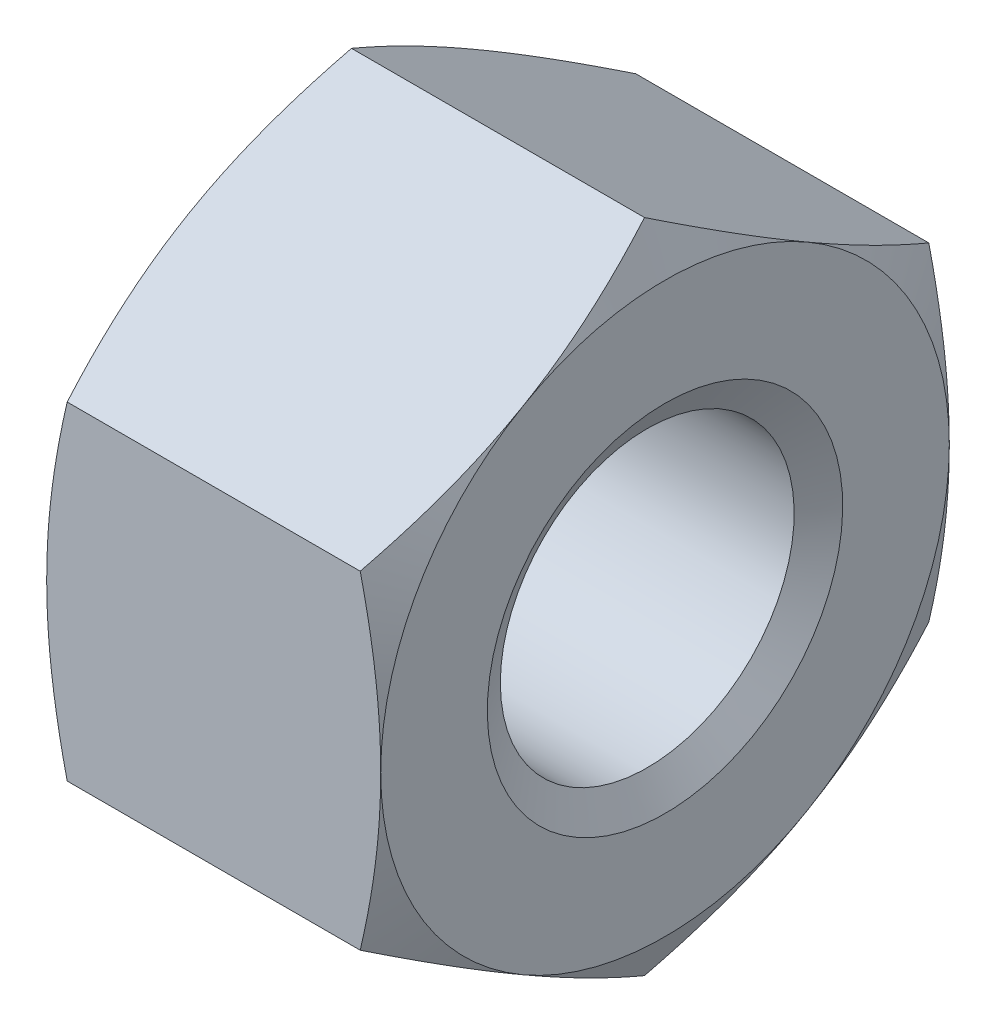
ISO-10303-21;
HEADER;
FILE_DESCRIPTION(('STEP AP214'),'2;1');
FILE_NAME('part.step','',(''),(''),'','','');
FILE_SCHEMA(('AUTOMOTIVE_DESIGN { 1 0 10303 214 1 1 1 1 }'));
ENDSEC;
DATA;
#1=APPLICATION_CONTEXT('core data for automotive mechanical design processes');
#2=APPLICATION_PROTOCOL_DEFINITION('international standard','automotive_design',2000,#1);
#3=PRODUCT_CONTEXT('',#1,'mechanical');
#4=PRODUCT('Part','Part','',(#3));
#5=PRODUCT_RELATED_PRODUCT_CATEGORY('part','',(#4));
#6=PRODUCT_DEFINITION_FORMATION('','',#4);
#7=PRODUCT_DEFINITION_CONTEXT('part definition',#1,'design');
#8=PRODUCT_DEFINITION('design','',#6,#7);
#9=PRODUCT_DEFINITION_SHAPE('','',#8);
#10=(LENGTH_UNIT() NAMED_UNIT(*) SI_UNIT(.MILLI.,.METRE.));
#11=(NAMED_UNIT(*) PLANE_ANGLE_UNIT() SI_UNIT($,.RADIAN.));
#12=(NAMED_UNIT(*) SI_UNIT($,.STERADIAN.) SOLID_ANGLE_UNIT());
#13=UNCERTAINTY_MEASURE_WITH_UNIT(LENGTH_MEASURE(1.E-05),#10,'distance_accuracy_value','');
#14=(GEOMETRIC_REPRESENTATION_CONTEXT(3) GLOBAL_UNCERTAINTY_ASSIGNED_CONTEXT((#13)) GLOBAL_UNIT_ASSIGNED_CONTEXT((#10,
#11,#12)) REPRESENTATION_CONTEXT('',''));
#15=CARTESIAN_POINT('',(0.,0.,0.));
#16=DIRECTION('',(0.,0.,1.));
#17=DIRECTION('',(1.,0.,0.));
#18=AXIS2_PLACEMENT_3D('',#15,#16,#17);
#19=CARTESIAN_POINT('',(0.125,0.,0.));
#20=DIRECTION('',(-1.,0.,0.));
#21=DIRECTION('',(0.,0.,1.));
#22=AXIS2_PLACEMENT_3D('',#19,#20,#21);
#23=CONICAL_SURFACE('',#22,2.28350635094611,1.0471975511966);
#24=CARTESIAN_POINT('',(0.25,0.,0.));
#25=DIRECTION('',(1.,0.,0.));
#26=DIRECTION('',(0.,1.,0.));
#27=AXIS2_PLACEMENT_3D('',#24,#25,#26);
#28=CIRCLE('',#27,2.067);
#29=CARTESIAN_POINT('',(0.25,2.067,0.));
#30=VERTEX_POINT('',#29);
#31=EDGE_CURVE('E9',#30,#30,#28,.T.);
#32=ORIENTED_EDGE('',*,*,#31,.T.);
#33=EDGE_LOOP('',(#32));
#34=FACE_BOUND('',#33,.T.);
#35=CARTESIAN_POINT('',(0.,0.,0.));
#36=DIRECTION('',(-1.,0.,0.));
#37=DIRECTION('',(0.,0.,1.));
#38=AXIS2_PLACEMENT_3D('',#35,#36,#37);
#39=CIRCLE('',#38,2.50001270189222);
#40=CARTESIAN_POINT('',(0.,0.,2.50001270189222));
#41=VERTEX_POINT('',#40);
#42=EDGE_CURVE('E25',#41,#41,#39,.T.);
#43=ORIENTED_EDGE('',*,*,#42,.T.);
#44=EDGE_LOOP('',(#43));
#45=FACE_BOUND('',#44,.T.);
#46=ADVANCED_FACE('F15',(#34,#45),#23,.F.);
#47=CARTESIAN_POINT('',(-8.39287337956546,0.,0.));
#48=DIRECTION('',(1.,0.,0.));
#49=DIRECTION('',(0.,1.,0.));
#50=AXIS2_PLACEMENT_3D('',#47,#48,#49);
#51=CYLINDRICAL_SURFACE('',#50,2.067);
#52=CARTESIAN_POINT('',(4.45,0.,0.));
#53=DIRECTION('',(-1.,0.,0.));
#54=DIRECTION('',(0.,0.,1.));
#55=AXIS2_PLACEMENT_3D('',#52,#53,#54);
#56=CIRCLE('',#55,2.067);
#57=CARTESIAN_POINT('',(4.45,0.,2.067));
#58=VERTEX_POINT('',#57);
#59=EDGE_CURVE('E330',#58,#58,#56,.T.);
#60=ORIENTED_EDGE('',*,*,#59,.F.);
#61=EDGE_LOOP('',(#60));
#62=FACE_BOUND('',#61,.T.);
#63=ORIENTED_EDGE('',*,*,#31,.F.);
#64=EDGE_LOOP('',(#63));
#65=FACE_BOUND('',#64,.T.);
#66=ADVANCED_FACE('F358',(#62,#65),#51,.F.);
#67=CARTESIAN_POINT('',(0.,0.,0.));
#68=DIRECTION('',(1.,0.,0.));
#69=DIRECTION('',(0.,0.,-1.));
#70=AXIS2_PLACEMENT_3D('',#67,#68,#69);
#71=PLANE('',#70);
#72=CARTESIAN_POINT('',(0.,0.,0.));
#73=DIRECTION('',(-1.,0.,0.));
#74=DIRECTION('',(0.,0.,1.));
#75=AXIS2_PLACEMENT_3D('',#72,#73,#74);
#76=CIRCLE('',#75,4.);
#77=CARTESIAN_POINT('',(0.,-3.46410161513775,-2.));
#78=VERTEX_POINT('',#77);
#79=CARTESIAN_POINT('',(0.,-3.46410161513776,2.));
#80=VERTEX_POINT('',#79);
#81=EDGE_CURVE('E346',#78,#80,#76,.T.);
#82=ORIENTED_EDGE('',*,*,#81,.T.);
#83=CARTESIAN_POINT('',(0.,0.,0.));
#84=DIRECTION('',(-1.,0.,0.));
#85=DIRECTION('',(0.,0.,1.));
#86=AXIS2_PLACEMENT_3D('',#83,#84,#85);
#87=CIRCLE('',#86,4.);
#88=CARTESIAN_POINT('',(0.,0.,4.));
#89=VERTEX_POINT('',#88);
#90=EDGE_CURVE('E343',#80,#89,#87,.T.);
#91=ORIENTED_EDGE('',*,*,#90,.T.);
#92=CARTESIAN_POINT('',(0.,0.,0.));
#93=DIRECTION('',(-1.,0.,0.));
#94=DIRECTION('',(0.,0.,1.));
#95=AXIS2_PLACEMENT_3D('',#92,#93,#94);
#96=CIRCLE('',#95,4.);
#97=CARTESIAN_POINT('',(0.,3.46410161513775,2.));
#98=VERTEX_POINT('',#97);
#99=EDGE_CURVE('E340',#89,#98,#96,.T.);
#100=ORIENTED_EDGE('',*,*,#99,.T.);
#101=CARTESIAN_POINT('',(0.,0.,0.));
#102=DIRECTION('',(-1.,0.,0.));
#103=DIRECTION('',(0.,0.,1.));
#104=AXIS2_PLACEMENT_3D('',#101,#102,#103);
#105=CIRCLE('',#104,4.);
#106=CARTESIAN_POINT('',(0.,3.46410161513776,-2.));
#107=VERTEX_POINT('',#106);
#108=EDGE_CURVE('E337',#98,#107,#105,.T.);
#109=ORIENTED_EDGE('',*,*,#108,.T.);
#110=CARTESIAN_POINT('',(0.,0.,0.));
#111=DIRECTION('',(-1.,0.,0.));
#112=DIRECTION('',(0.,0.,1.));
#113=AXIS2_PLACEMENT_3D('',#110,#111,#112);
#114=CIRCLE('',#113,4.);
#115=CARTESIAN_POINT('',(0.,0.,-4.));
#116=VERTEX_POINT('',#115);
#117=EDGE_CURVE('E334',#107,#116,#114,.T.);
#118=ORIENTED_EDGE('',*,*,#117,.T.);
#119=CARTESIAN_POINT('',(0.,0.,0.));
#120=DIRECTION('',(-1.,0.,0.));
#121=DIRECTION('',(0.,0.,1.));
#122=AXIS2_PLACEMENT_3D('',#119,#120,#121);
#123=CIRCLE('',#122,4.);
#124=EDGE_CURVE('E331',#116,#78,#123,.T.);
#125=ORIENTED_EDGE('',*,*,#124,.T.);
#126=EDGE_LOOP('',(#82,#91,#100,#109,#118,#125));
#127=FACE_BOUND('',#126,.T.);
#128=ORIENTED_EDGE('',*,*,#42,.F.);
#129=EDGE_LOOP('',(#128));
#130=FACE_BOUND('',#129,.T.);
#131=ADVANCED_FACE('F355',(#127,#130),#71,.F.);
#132=CARTESIAN_POINT('',(4.575,0.,0.));
#133=DIRECTION('',(1.,0.,0.));
#134=DIRECTION('',(0.,1.,0.));
#135=AXIS2_PLACEMENT_3D('',#132,#133,#134);
#136=CONICAL_SURFACE('',#135,2.28350635094611,1.0471975511966);
#137=ORIENTED_EDGE('',*,*,#59,.T.);
#138=EDGE_LOOP('',(#137));
#139=FACE_BOUND('',#138,.T.);
#140=CARTESIAN_POINT('',(4.7,0.,0.));
#141=DIRECTION('',(1.,0.,0.));
#142=DIRECTION('',(0.,1.,0.));
#143=AXIS2_PLACEMENT_3D('',#140,#141,#142);
#144=CIRCLE('',#143,2.50001270189222);
#145=CARTESIAN_POINT('',(4.7,2.50001270189222,0.));
#146=VERTEX_POINT('',#145);
#147=EDGE_CURVE('E327',#146,#146,#144,.T.);
#148=ORIENTED_EDGE('',*,*,#147,.T.);
#149=EDGE_LOOP('',(#148));
#150=FACE_BOUND('',#149,.T.);
#151=ADVANCED_FACE('F357',(#139,#150),#136,.F.);
#152=CARTESIAN_POINT('',(4.7,0.,0.));
#153=DIRECTION('',(1.,0.,0.));
#154=DIRECTION('',(0.,0.,-1.));
#155=AXIS2_PLACEMENT_3D('',#152,#153,#154);
#156=PLANE('',#155);
#157=CARTESIAN_POINT('',(4.7,0.,0.));
#158=DIRECTION('',(1.,0.,0.));
#159=DIRECTION('',(0.,1.,0.));
#160=AXIS2_PLACEMENT_3D('',#157,#158,#159);
#161=CIRCLE('',#160,4.);
#162=CARTESIAN_POINT('',(4.7,-3.46410161513775,-2.));
#163=VERTEX_POINT('',#162);
#164=CARTESIAN_POINT('',(4.7,0.,-4.));
#165=VERTEX_POINT('',#164);
#166=EDGE_CURVE('E324',#163,#165,#161,.T.);
#167=ORIENTED_EDGE('',*,*,#166,.T.);
#168=CARTESIAN_POINT('',(4.7,0.,0.));
#169=DIRECTION('',(1.,0.,0.));
#170=DIRECTION('',(0.,1.,0.));
#171=AXIS2_PLACEMENT_3D('',#168,#169,#170);
#172=CIRCLE('',#171,4.);
#173=CARTESIAN_POINT('',(4.7,3.46410161513776,-2.));
#174=VERTEX_POINT('',#173);
#175=EDGE_CURVE('E322',#165,#174,#172,.T.);
#176=ORIENTED_EDGE('',*,*,#175,.T.);
#177=CARTESIAN_POINT('',(4.7,0.,0.));
#178=DIRECTION('',(1.,0.,0.));
#179=DIRECTION('',(0.,1.,0.));
#180=AXIS2_PLACEMENT_3D('',#177,#178,#179);
#181=CIRCLE('',#180,4.);
#182=CARTESIAN_POINT('',(4.7,3.46410161513775,2.));
#183=VERTEX_POINT('',#182);
#184=EDGE_CURVE('E112',#174,#183,#181,.T.);
#185=ORIENTED_EDGE('',*,*,#184,.T.);
#186=CARTESIAN_POINT('',(4.7,0.,0.));
#187=DIRECTION('',(1.,0.,0.));
#188=DIRECTION('',(0.,1.,0.));
#189=AXIS2_PLACEMENT_3D('',#186,#187,#188);
#190=CIRCLE('',#189,4.);
#191=CARTESIAN_POINT('',(4.7,0.,4.));
#192=VERTEX_POINT('',#191);
#193=EDGE_CURVE('E318',#183,#192,#190,.T.);
#194=ORIENTED_EDGE('',*,*,#193,.T.);
#195=CARTESIAN_POINT('',(4.7,0.,0.));
#196=DIRECTION('',(1.,0.,0.));
#197=DIRECTION('',(0.,1.,0.));
#198=AXIS2_PLACEMENT_3D('',#195,#196,#197);
#199=CIRCLE('',#198,4.);
#200=CARTESIAN_POINT('',(4.7,-3.46410161513776,2.));
#201=VERTEX_POINT('',#200);
#202=EDGE_CURVE('E315',#192,#201,#199,.T.);
#203=ORIENTED_EDGE('',*,*,#202,.T.);
#204=CARTESIAN_POINT('',(4.7,0.,0.));
#205=DIRECTION('',(1.,0.,0.));
#206=DIRECTION('',(0.,1.,0.));
#207=AXIS2_PLACEMENT_3D('',#204,#205,#206);
#208=CIRCLE('',#207,4.);
#209=EDGE_CURVE('E237',#201,#163,#208,.T.);
#210=ORIENTED_EDGE('',*,*,#209,.T.);
#211=EDGE_LOOP('',(#167,#176,#185,#194,#203,#210));
#212=FACE_BOUND('',#211,.T.);
#213=ORIENTED_EDGE('',*,*,#147,.F.);
#214=EDGE_LOOP('',(#213));
#215=FACE_BOUND('',#214,.T.);
#216=ADVANCED_FACE('F366',(#212,#215),#156,.T.);
#217=CARTESIAN_POINT('',(0.144276091533892,0.,0.));
#218=DIRECTION('',(1.,0.,0.));
#219=DIRECTION('',(0.,0.,1.));
#220=AXIS2_PLACEMENT_3D('',#217,#218,#219);
#221=CONICAL_SURFACE('',#220,4.3094010767585,1.13446401379631);
#222=CARTESIAN_POINT('',(0.,-3.46410161513776,2.));
#223=CARTESIAN_POINT('',(0.,-4.,1.07179676972449));
#224=CARTESIAN_POINT('',(0.288552183067785,-4.618802153517,0.));
#225=(BOUNDED_CURVE() B_SPLINE_CURVE(2,(#222,#223,#224),.UNSPECIFIED.,.F.,
.F.) B_SPLINE_CURVE_WITH_KNOTS((3,3),(0.233129855179429,0.466259710358859),
.UNSPECIFIED.) CURVE() GEOMETRIC_REPRESENTATION_ITEM() RATIONAL_B_SPLINE_CURVE((1.,
1.03795484930205,1.)) REPRESENTATION_ITEM(''));
#226=CARTESIAN_POINT('',(0.288552183067785,-4.61880215351701,0.));
#227=VERTEX_POINT('',#226);
#228=EDGE_CURVE('E34',#80,#227,#225,.T.);
#229=ORIENTED_EDGE('',*,*,#228,.F.);
#230=ORIENTED_EDGE('',*,*,#81,.F.);
#231=CARTESIAN_POINT('',(0.288552183067785,-4.61880215351701,0.));
#232=CARTESIAN_POINT('',(0.,-4.,-1.07179676972449));
#233=CARTESIAN_POINT('',(0.,-3.46410161513775,-2.));
#234=(BOUNDED_CURVE() B_SPLINE_CURVE(2,(#231,#232,#233),.UNSPECIFIED.,.F.,
.F.) B_SPLINE_CURVE_WITH_KNOTS((3,3),(0.,0.23312985517943),
.UNSPECIFIED.) CURVE() GEOMETRIC_REPRESENTATION_ITEM() RATIONAL_B_SPLINE_CURVE((1.,
1.03795484930204,1.)) REPRESENTATION_ITEM(''));
#235=EDGE_CURVE('E224',#227,#78,#234,.T.);
#236=ORIENTED_EDGE('',*,*,#235,.F.);
#237=EDGE_LOOP('',(#229,#230,#236));
#238=FACE_BOUND('',#237,.T.);
#239=ADVANCED_FACE('F379',(#238),#221,.T.);
#240=CARTESIAN_POINT('',(0.144276091533892,0.,0.));
#241=DIRECTION('',(1.,0.,0.));
#242=DIRECTION('',(0.,0.,1.));
#243=AXIS2_PLACEMENT_3D('',#240,#241,#242);
#244=CONICAL_SURFACE('',#243,4.3094010767585,1.13446401379631);
#245=CARTESIAN_POINT('',(0.288552183067785,-2.30940107675848,-4.00000000000001));
#246=CARTESIAN_POINT('',(0.,-1.07179676972447,-4.00000000000001));
#247=CARTESIAN_POINT('',(0.,0.,-4.));
#248=(BOUNDED_CURVE() B_SPLINE_CURVE(2,(#245,#246,#247),.UNSPECIFIED.,.F.,
.F.) B_SPLINE_CURVE_WITH_KNOTS((3,3),(0.,0.233129855179429),
.UNSPECIFIED.) CURVE() GEOMETRIC_REPRESENTATION_ITEM() RATIONAL_B_SPLINE_CURVE((1.,
1.03795484930204,1.)) REPRESENTATION_ITEM(''));
#249=CARTESIAN_POINT('',(0.288552183067785,-2.30940107675848,-4.00000000000001));
#250=VERTEX_POINT('',#249);
#251=EDGE_CURVE('E157',#250,#116,#248,.T.);
#252=ORIENTED_EDGE('',*,*,#251,.F.);
#253=CARTESIAN_POINT('',(0.,-3.46410161513775,-2.));
#254=CARTESIAN_POINT('',(0.,-2.9282032302755,-2.92820323027551));
#255=CARTESIAN_POINT('',(0.288552183067785,-2.3094010767585,-4.));
#256=(BOUNDED_CURVE() B_SPLINE_CURVE(2,(#253,#254,#255),.UNSPECIFIED.,.F.,
.F.) B_SPLINE_CURVE_WITH_KNOTS((3,3),(0.23312985517943,0.46625971035886),
.UNSPECIFIED.) CURVE() GEOMETRIC_REPRESENTATION_ITEM() RATIONAL_B_SPLINE_CURVE((1.,
1.03795484930204,1.)) REPRESENTATION_ITEM(''));
#257=EDGE_CURVE('E284',#78,#250,#256,.T.);
#258=ORIENTED_EDGE('',*,*,#257,.F.);
#259=ORIENTED_EDGE('',*,*,#124,.F.);
#260=EDGE_LOOP('',(#252,#258,#259));
#261=FACE_BOUND('',#260,.T.);
#262=ADVANCED_FACE('F382',(#261),#244,.T.);
#263=CARTESIAN_POINT('',(0.144276091533892,0.,0.));
#264=DIRECTION('',(1.,0.,0.));
#265=DIRECTION('',(0.,0.,1.));
#266=AXIS2_PLACEMENT_3D('',#263,#264,#265);
#267=CONICAL_SURFACE('',#266,4.3094010767585,1.13446401379631);
#268=CARTESIAN_POINT('',(0.,0.,4.));
#269=CARTESIAN_POINT('',(0.,-1.07179676972449,4.));
#270=CARTESIAN_POINT('',(0.288552183067785,-2.3094010767585,4.));
#271=(BOUNDED_CURVE() B_SPLINE_CURVE(2,(#268,#269,#270),.UNSPECIFIED.,.F.,
.F.) B_SPLINE_CURVE_WITH_KNOTS((3,3),(0.233129855179429,0.466259710358859),
.UNSPECIFIED.) CURVE() GEOMETRIC_REPRESENTATION_ITEM() RATIONAL_B_SPLINE_CURVE((1.,
1.03795484930203,1.)) REPRESENTATION_ITEM(''));
#272=CARTESIAN_POINT('',(0.288552183067785,-2.3094010767585,4.));
#273=VERTEX_POINT('',#272);
#274=EDGE_CURVE('E142',#89,#273,#271,.T.);
#275=ORIENTED_EDGE('',*,*,#274,.F.);
#276=ORIENTED_EDGE('',*,*,#90,.F.);
#277=CARTESIAN_POINT('',(0.288552183067785,-2.30940107675851,4.));
#278=CARTESIAN_POINT('',(0.,-2.92820323027551,2.92820323027551));
#279=CARTESIAN_POINT('',(0.,-3.46410161513776,2.));
#280=(BOUNDED_CURVE() B_SPLINE_CURVE(2,(#277,#278,#279),.UNSPECIFIED.,.F.,
.F.) B_SPLINE_CURVE_WITH_KNOTS((3,3),(0.,0.233129855179429),
.UNSPECIFIED.) CURVE() GEOMETRIC_REPRESENTATION_ITEM() RATIONAL_B_SPLINE_CURVE((1.,
1.03795484930205,1.)) REPRESENTATION_ITEM(''));
#281=EDGE_CURVE('E185',#273,#80,#280,.T.);
#282=ORIENTED_EDGE('',*,*,#281,.F.);
#283=EDGE_LOOP('',(#275,#276,#282));
#284=FACE_BOUND('',#283,.T.);
#285=ADVANCED_FACE('F385',(#284),#267,.T.);
#286=CARTESIAN_POINT('',(0.144276091533892,0.,0.));
#287=DIRECTION('',(1.,0.,0.));
#288=DIRECTION('',(0.,0.,1.));
#289=AXIS2_PLACEMENT_3D('',#286,#287,#288);
#290=CONICAL_SURFACE('',#289,4.3094010767585,1.13446401379631);
#291=CARTESIAN_POINT('',(0.288552183067785,2.30940107675852,-3.99999999999999));
#292=CARTESIAN_POINT('',(0.,2.92820323027552,-2.9282032302755));
#293=CARTESIAN_POINT('',(0.,3.46410161513776,-2.));
#294=(BOUNDED_CURVE() B_SPLINE_CURVE(2,(#291,#292,#293),.UNSPECIFIED.,.F.,
.F.) B_SPLINE_CURVE_WITH_KNOTS((3,3),(0.,0.233129855179429),
.UNSPECIFIED.) CURVE() GEOMETRIC_REPRESENTATION_ITEM() RATIONAL_B_SPLINE_CURVE((1.,
1.03795484930204,1.)) REPRESENTATION_ITEM(''));
#295=CARTESIAN_POINT('',(0.288552183067785,2.30940107675851,-3.99999999999999));
#296=VERTEX_POINT('',#295);
#297=EDGE_CURVE('E152',#296,#107,#294,.T.);
#298=ORIENTED_EDGE('',*,*,#297,.F.);
#299=CARTESIAN_POINT('',(0.,0.,-4.));
#300=CARTESIAN_POINT('',(0.,1.07179676972449,-4.));
#301=CARTESIAN_POINT('',(0.288552183067785,2.3094010767585,-4.));
#302=(BOUNDED_CURVE() B_SPLINE_CURVE(2,(#299,#300,#301),.UNSPECIFIED.,.F.,
.F.) B_SPLINE_CURVE_WITH_KNOTS((3,3),(0.233129855179429,0.466259710358857),
.UNSPECIFIED.) CURVE() GEOMETRIC_REPRESENTATION_ITEM() RATIONAL_B_SPLINE_CURVE((1.,
1.03795484930204,1.)) REPRESENTATION_ITEM(''));
#303=EDGE_CURVE('E149',#116,#296,#302,.T.);
#304=ORIENTED_EDGE('',*,*,#303,.F.);
#305=ORIENTED_EDGE('',*,*,#117,.F.);
#306=EDGE_LOOP('',(#298,#304,#305));
#307=FACE_BOUND('',#306,.T.);
#308=ADVANCED_FACE('F389',(#307),#290,.T.);
#309=CARTESIAN_POINT('',(0.144276091533892,0.,0.));
#310=DIRECTION('',(1.,0.,0.));
#311=DIRECTION('',(0.,0.,1.));
#312=AXIS2_PLACEMENT_3D('',#309,#310,#311);
#313=CONICAL_SURFACE('',#312,4.3094010767585,1.13446401379631);
#314=CARTESIAN_POINT('',(0.,3.46410161513775,2.));
#315=CARTESIAN_POINT('',(0.,2.92820323027551,2.92820323027551));
#316=CARTESIAN_POINT('',(0.288552183067785,2.3094010767585,4.));
#317=(BOUNDED_CURVE() B_SPLINE_CURVE(2,(#314,#315,#316),.UNSPECIFIED.,.F.,
.F.) B_SPLINE_CURVE_WITH_KNOTS((3,3),(0.233129855179429,0.466259710358859),
.UNSPECIFIED.) CURVE() GEOMETRIC_REPRESENTATION_ITEM() RATIONAL_B_SPLINE_CURVE((1.,
1.03795484930205,1.)) REPRESENTATION_ITEM(''));
#318=CARTESIAN_POINT('',(0.288552183067785,2.3094010767585,4.));
#319=VERTEX_POINT('',#318);
#320=EDGE_CURVE('E238',#98,#319,#317,.T.);
#321=ORIENTED_EDGE('',*,*,#320,.F.);
#322=ORIENTED_EDGE('',*,*,#99,.F.);
#323=CARTESIAN_POINT('',(0.288552183067785,2.3094010767585,4.));
#324=CARTESIAN_POINT('',(0.,1.07179676972449,4.));
#325=CARTESIAN_POINT('',(0.,0.,4.));
#326=(BOUNDED_CURVE() B_SPLINE_CURVE(2,(#323,#324,#325),.UNSPECIFIED.,.F.,
.F.) B_SPLINE_CURVE_WITH_KNOTS((3,3),(0.,0.233129855179429),
.UNSPECIFIED.) CURVE() GEOMETRIC_REPRESENTATION_ITEM() RATIONAL_B_SPLINE_CURVE((1.,
1.03795484930203,1.)) REPRESENTATION_ITEM(''));
#327=EDGE_CURVE('E127',#319,#89,#326,.T.);
#328=ORIENTED_EDGE('',*,*,#327,.F.);
#329=EDGE_LOOP('',(#321,#322,#328));
#330=FACE_BOUND('',#329,.T.);
#331=ADVANCED_FACE('F393',(#330),#313,.T.);
#332=CARTESIAN_POINT('',(0.144276091533892,0.,0.));
#333=DIRECTION('',(1.,0.,0.));
#334=DIRECTION('',(0.,0.,1.));
#335=AXIS2_PLACEMENT_3D('',#332,#333,#334);
#336=CONICAL_SURFACE('',#335,4.3094010767585,1.13446401379631);
#337=CARTESIAN_POINT('',(0.,3.46410161513776,-2.));
#338=CARTESIAN_POINT('',(0.,4.,-1.07179676972449));
#339=CARTESIAN_POINT('',(0.288552183067785,4.61880215351701,0.));
#340=(BOUNDED_CURVE() B_SPLINE_CURVE(2,(#337,#338,#339),.UNSPECIFIED.,.F.,
.F.) B_SPLINE_CURVE_WITH_KNOTS((3,3),(0.233129855179429,0.466259710358858),
.UNSPECIFIED.) CURVE() GEOMETRIC_REPRESENTATION_ITEM() RATIONAL_B_SPLINE_CURVE((1.,
1.03795484930205,1.)) REPRESENTATION_ITEM(''));
#341=CARTESIAN_POINT('',(0.288552183067785,4.61880215351701,0.));
#342=VERTEX_POINT('',#341);
#343=EDGE_CURVE('E131',#107,#342,#340,.T.);
#344=ORIENTED_EDGE('',*,*,#343,.F.);
#345=ORIENTED_EDGE('',*,*,#108,.F.);
#346=CARTESIAN_POINT('',(0.288552183067785,4.61880215351701,0.));
#347=CARTESIAN_POINT('',(0.,4.,1.07179676972449));
#348=CARTESIAN_POINT('',(0.,3.46410161513775,2.));
#349=(BOUNDED_CURVE() B_SPLINE_CURVE(2,(#346,#347,#348),.UNSPECIFIED.,.F.,
.F.) B_SPLINE_CURVE_WITH_KNOTS((3,3),(0.,0.233129855179429),
.UNSPECIFIED.) CURVE() GEOMETRIC_REPRESENTATION_ITEM() RATIONAL_B_SPLINE_CURVE((1.,
1.03795484930205,1.)) REPRESENTATION_ITEM(''));
#350=EDGE_CURVE('E231',#342,#98,#349,.T.);
#351=ORIENTED_EDGE('',*,*,#350,.F.);
#352=EDGE_LOOP('',(#344,#345,#351));
#353=FACE_BOUND('',#352,.T.);
#354=ADVANCED_FACE('F395',(#353),#336,.T.);
#355=CARTESIAN_POINT('',(4.55572390846611,0.,0.));
#356=DIRECTION('',(-1.,0.,0.));
#357=DIRECTION('',(0.,0.,1.));
#358=AXIS2_PLACEMENT_3D('',#355,#356,#357);
#359=CONICAL_SURFACE('',#358,4.3094010767585,1.13446401379631);
#360=CARTESIAN_POINT('',(4.41144781693221,-4.61880215351701,0.));
#361=CARTESIAN_POINT('',(4.7,-4.,1.07179676972448));
#362=CARTESIAN_POINT('',(4.7,-3.46410161513776,2.));
#363=(BOUNDED_CURVE() B_SPLINE_CURVE(2,(#360,#361,#362),.UNSPECIFIED.,.F.,
.F.) B_SPLINE_CURVE_WITH_KNOTS((3,3),(0.,0.23312985517943),
.UNSPECIFIED.) CURVE() GEOMETRIC_REPRESENTATION_ITEM() RATIONAL_B_SPLINE_CURVE((1.,
1.03795484930201,1.)) REPRESENTATION_ITEM(''));
#364=CARTESIAN_POINT('',(4.41144781693222,-4.61880215351701,0.));
#365=VERTEX_POINT('',#364);
#366=EDGE_CURVE('E146',#365,#201,#363,.T.);
#367=ORIENTED_EDGE('',*,*,#366,.F.);
#368=CARTESIAN_POINT('',(4.7,-3.46410161513775,-2.));
#369=CARTESIAN_POINT('',(4.7,-4.,-1.07179676972449));
#370=CARTESIAN_POINT('',(4.41144781693221,-4.61880215351701,0.));
#371=(BOUNDED_CURVE() B_SPLINE_CURVE(2,(#368,#369,#370),.UNSPECIFIED.,.F.,
.F.) B_SPLINE_CURVE_WITH_KNOTS((3,3),(0.23312985517943,0.46625971035886),
.UNSPECIFIED.) CURVE() GEOMETRIC_REPRESENTATION_ITEM() RATIONAL_B_SPLINE_CURVE((1.,
1.03795484930206,1.)) REPRESENTATION_ITEM(''));
#372=EDGE_CURVE('E211',#163,#365,#371,.T.);
#373=ORIENTED_EDGE('',*,*,#372,.F.);
#374=ORIENTED_EDGE('',*,*,#209,.F.);
#375=EDGE_LOOP('',(#367,#373,#374));
#376=FACE_BOUND('',#375,.T.);
#377=ADVANCED_FACE('F398',(#376),#359,.T.);
#378=CARTESIAN_POINT('',(4.55572390846611,0.,0.));
#379=DIRECTION('',(-1.,0.,0.));
#380=DIRECTION('',(0.,0.,1.));
#381=AXIS2_PLACEMENT_3D('',#378,#379,#380);
#382=CONICAL_SURFACE('',#381,4.3094010767585,1.13446401379631);
#383=CARTESIAN_POINT('',(4.7,0.,-4.));
#384=CARTESIAN_POINT('',(4.7,-1.07179676972448,-4.00000000000001));
#385=CARTESIAN_POINT('',(4.41144781693221,-2.30940107675849,-4.00000000000001));
#386=(BOUNDED_CURVE() B_SPLINE_CURVE(2,(#383,#384,#385),.UNSPECIFIED.,.F.,
.F.) B_SPLINE_CURVE_WITH_KNOTS((3,3),(0.233129855179429,0.466259710358859),
.UNSPECIFIED.) CURVE() GEOMETRIC_REPRESENTATION_ITEM() RATIONAL_B_SPLINE_CURVE((1.,
1.03795484930207,1.)) REPRESENTATION_ITEM(''));
#387=CARTESIAN_POINT('',(4.41144781693222,-2.30940107675849,-4.00000000000001));
#388=VERTEX_POINT('',#387);
#389=EDGE_CURVE('E154',#165,#388,#386,.T.);
#390=ORIENTED_EDGE('',*,*,#389,.F.);
#391=ORIENTED_EDGE('',*,*,#166,.F.);
#392=CARTESIAN_POINT('',(4.41144781693221,-2.30940107675849,-4.00000000000001));
#393=CARTESIAN_POINT('',(4.7,-2.9282032302755,-2.92820323027551));
#394=CARTESIAN_POINT('',(4.7,-3.46410161513775,-2.));
#395=(BOUNDED_CURVE() B_SPLINE_CURVE(2,(#392,#393,#394),.UNSPECIFIED.,.F.,
.F.) B_SPLINE_CURVE_WITH_KNOTS((3,3),(0.,0.23312985517943),
.UNSPECIFIED.) CURVE() GEOMETRIC_REPRESENTATION_ITEM() RATIONAL_B_SPLINE_CURVE((1.,
1.03795484930208,1.)) REPRESENTATION_ITEM(''));
#396=EDGE_CURVE('E204',#388,#163,#395,.T.);
#397=ORIENTED_EDGE('',*,*,#396,.F.);
#398=EDGE_LOOP('',(#390,#391,#397));
#399=FACE_BOUND('',#398,.T.);
#400=ADVANCED_FACE('F405',(#399),#382,.T.);
#401=CARTESIAN_POINT('',(4.55572390846611,0.,0.));
#402=DIRECTION('',(-1.,0.,0.));
#403=DIRECTION('',(0.,0.,1.));
#404=AXIS2_PLACEMENT_3D('',#401,#402,#403);
#405=CONICAL_SURFACE('',#404,4.3094010767585,1.13446401379631);
#406=CARTESIAN_POINT('',(4.41144781693221,-2.30940107675851,4.));
#407=CARTESIAN_POINT('',(4.7,-1.07179676972449,4.));
#408=CARTESIAN_POINT('',(4.7,0.,4.));
#409=(BOUNDED_CURVE() B_SPLINE_CURVE(2,(#406,#407,#408),.UNSPECIFIED.,.F.,
.F.) B_SPLINE_CURVE_WITH_KNOTS((3,3),(0.,0.23312985517943),
.UNSPECIFIED.) CURVE() GEOMETRIC_REPRESENTATION_ITEM() RATIONAL_B_SPLINE_CURVE((1.,
1.03795484930202,1.)) REPRESENTATION_ITEM(''));
#410=CARTESIAN_POINT('',(4.41144781693222,-2.3094010767585,4.));
#411=VERTEX_POINT('',#410);
#412=EDGE_CURVE('E143',#411,#192,#409,.T.);
#413=ORIENTED_EDGE('',*,*,#412,.F.);
#414=CARTESIAN_POINT('',(4.7,-3.46410161513776,2.));
#415=CARTESIAN_POINT('',(4.7,-2.92820323027551,2.92820323027552));
#416=CARTESIAN_POINT('',(4.41144781693221,-2.3094010767585,4.00000000000001));
#417=(BOUNDED_CURVE() B_SPLINE_CURVE(2,(#414,#415,#416),.UNSPECIFIED.,.F.,
.F.) B_SPLINE_CURVE_WITH_KNOTS((3,3),(0.23312985517943,0.466259710358861),
.UNSPECIFIED.) CURVE() GEOMETRIC_REPRESENTATION_ITEM() RATIONAL_B_SPLINE_CURVE((1.,
1.03795484930199,1.)) REPRESENTATION_ITEM(''));
#418=EDGE_CURVE('E134',#201,#411,#417,.T.);
#419=ORIENTED_EDGE('',*,*,#418,.F.);
#420=ORIENTED_EDGE('',*,*,#202,.F.);
#421=EDGE_LOOP('',(#413,#419,#420));
#422=FACE_BOUND('',#421,.T.);
#423=ADVANCED_FACE('F409',(#422),#405,.T.);
#424=CARTESIAN_POINT('',(4.55572390846611,0.,0.));
#425=DIRECTION('',(-1.,0.,0.));
#426=DIRECTION('',(0.,0.,1.));
#427=AXIS2_PLACEMENT_3D('',#424,#425,#426);
#428=CONICAL_SURFACE('',#427,4.3094010767585,1.13446401379631);
#429=CARTESIAN_POINT('',(4.41144781693221,2.3094010767585,4.));
#430=CARTESIAN_POINT('',(4.7,2.92820323027551,2.9282032302755));
#431=CARTESIAN_POINT('',(4.7,3.46410161513775,2.));
#432=(BOUNDED_CURVE() B_SPLINE_CURVE(2,(#429,#430,#431),.UNSPECIFIED.,.F.,
.F.) B_SPLINE_CURVE_WITH_KNOTS((3,3),(0.,0.23312985517943),
.UNSPECIFIED.) CURVE() GEOMETRIC_REPRESENTATION_ITEM() RATIONAL_B_SPLINE_CURVE((1.,
1.03795484930207,1.)) REPRESENTATION_ITEM(''));
#433=CARTESIAN_POINT('',(4.41144781693222,2.3094010767585,4.));
#434=VERTEX_POINT('',#433);
#435=EDGE_CURVE('E125',#434,#183,#432,.T.);
#436=ORIENTED_EDGE('',*,*,#435,.F.);
#437=CARTESIAN_POINT('',(4.7,0.,4.));
#438=CARTESIAN_POINT('',(4.7,1.07179676972449,4.));
#439=CARTESIAN_POINT('',(4.41144781693221,2.30940107675851,4.));
#440=(BOUNDED_CURVE() B_SPLINE_CURVE(2,(#437,#438,#439),.UNSPECIFIED.,.F.,
.F.) B_SPLINE_CURVE_WITH_KNOTS((3,3),(0.23312985517943,0.46625971035886),
.UNSPECIFIED.) CURVE() GEOMETRIC_REPRESENTATION_ITEM() RATIONAL_B_SPLINE_CURVE((1.,
1.03795484930202,1.)) REPRESENTATION_ITEM(''));
#441=EDGE_CURVE('E178',#192,#434,#440,.T.);
#442=ORIENTED_EDGE('',*,*,#441,.F.);
#443=ORIENTED_EDGE('',*,*,#193,.F.);
#444=EDGE_LOOP('',(#436,#442,#443));
#445=FACE_BOUND('',#444,.T.);
#446=ADVANCED_FACE('F414',(#445),#428,.T.);
#447=CARTESIAN_POINT('',(4.55572390846611,0.,0.));
#448=DIRECTION('',(-1.,0.,0.));
#449=DIRECTION('',(0.,0.,1.));
#450=AXIS2_PLACEMENT_3D('',#447,#448,#449);
#451=CONICAL_SURFACE('',#450,4.3094010767585,1.13446401379631);
#452=CARTESIAN_POINT('',(4.7,3.46410161513776,-2.));
#453=CARTESIAN_POINT('',(4.7,2.92820323027552,-2.9282032302755));
#454=CARTESIAN_POINT('',(4.41144781693221,2.30940107675851,-3.99999999999999));
#455=(BOUNDED_CURVE() B_SPLINE_CURVE(2,(#452,#453,#454),.UNSPECIFIED.,.F.,
.F.) B_SPLINE_CURVE_WITH_KNOTS((3,3),(0.233129855179429,0.466259710358858),
.UNSPECIFIED.) CURVE() GEOMETRIC_REPRESENTATION_ITEM() RATIONAL_B_SPLINE_CURVE((1.,
1.03795484930202,1.)) REPRESENTATION_ITEM(''));
#456=CARTESIAN_POINT('',(4.41144781693222,2.30940107675851,-3.99999999999999));
#457=VERTEX_POINT('',#456);
#458=EDGE_CURVE('E117',#174,#457,#455,.T.);
#459=ORIENTED_EDGE('',*,*,#458,.F.);
#460=ORIENTED_EDGE('',*,*,#175,.F.);
#461=CARTESIAN_POINT('',(4.41144781693221,2.30940107675851,-4.));
#462=CARTESIAN_POINT('',(4.7,1.0717967697245,-4.));
#463=CARTESIAN_POINT('',(4.7,0.,-4.));
#464=(BOUNDED_CURVE() B_SPLINE_CURVE(2,(#461,#462,#463),.UNSPECIFIED.,.F.,
.F.) B_SPLINE_CURVE_WITH_KNOTS((3,3),(0.,0.233129855179429),
.UNSPECIFIED.) CURVE() GEOMETRIC_REPRESENTATION_ITEM() RATIONAL_B_SPLINE_CURVE((1.,
1.03795484930206,1.)) REPRESENTATION_ITEM(''));
#465=EDGE_CURVE('E101',#457,#165,#464,.T.);
#466=ORIENTED_EDGE('',*,*,#465,.F.);
#467=EDGE_LOOP('',(#459,#460,#466));
#468=FACE_BOUND('',#467,.T.);
#469=ADVANCED_FACE('F411',(#468),#451,.T.);
#470=CARTESIAN_POINT('',(4.55572390846611,0.,0.));
#471=DIRECTION('',(-1.,0.,0.));
#472=DIRECTION('',(0.,0.,1.));
#473=AXIS2_PLACEMENT_3D('',#470,#471,#472);
#474=CONICAL_SURFACE('',#473,4.3094010767585,1.13446401379631);
#475=CARTESIAN_POINT('',(4.7,3.46410161513775,2.));
#476=CARTESIAN_POINT('',(4.7,4.,1.0717967697245));
#477=CARTESIAN_POINT('',(4.41144781693221,4.61880215351701,0.));
#478=(BOUNDED_CURVE() B_SPLINE_CURVE(2,(#475,#476,#477),.UNSPECIFIED.,.F.,
.F.) B_SPLINE_CURVE_WITH_KNOTS((3,3),(0.23312985517943,0.466259710358859),
.UNSPECIFIED.) CURVE() GEOMETRIC_REPRESENTATION_ITEM() RATIONAL_B_SPLINE_CURVE((1.,
1.03795484930205,1.)) REPRESENTATION_ITEM(''));
#479=CARTESIAN_POINT('',(4.41144781693222,4.61880215351701,0.));
#480=VERTEX_POINT('',#479);
#481=EDGE_CURVE('E110',#183,#480,#478,.T.);
#482=ORIENTED_EDGE('',*,*,#481,.F.);
#483=ORIENTED_EDGE('',*,*,#184,.F.);
#484=CARTESIAN_POINT('',(4.41144781693221,4.61880215351701,0.));
#485=CARTESIAN_POINT('',(4.7,4.,-1.07179676972449));
#486=CARTESIAN_POINT('',(4.7,3.46410161513776,-2.));
#487=(BOUNDED_CURVE() B_SPLINE_CURVE(2,(#484,#485,#486),.UNSPECIFIED.,.F.,
.F.) B_SPLINE_CURVE_WITH_KNOTS((3,3),(0.,0.233129855179429),
.UNSPECIFIED.) CURVE() GEOMETRIC_REPRESENTATION_ITEM() RATIONAL_B_SPLINE_CURVE((1.,
1.03795484930203,1.)) REPRESENTATION_ITEM(''));
#488=EDGE_CURVE('E108',#480,#174,#487,.T.);
#489=ORIENTED_EDGE('',*,*,#488,.F.);
#490=EDGE_LOOP('',(#482,#483,#489));
#491=FACE_BOUND('',#490,.T.);
#492=ADVANCED_FACE('F17',(#491),#474,.T.);
#493=CARTESIAN_POINT('',(0.,2.3094010767585,4.));
#494=DIRECTION('',(0.,0.866025403784438,0.5));
#495=DIRECTION('',(0.,-0.5,0.866025403784438));
#496=AXIS2_PLACEMENT_3D('',#493,#494,#495);
#497=PLANE('',#496);
#498=ORIENTED_EDGE('',*,*,#350,.T.);
#499=ORIENTED_EDGE('',*,*,#320,.T.);
#500=DIRECTION('',(1.,0.,0.));
#501=VECTOR('',#500,1.);
#502=CARTESIAN_POINT('',(0.,2.3094010767585,4.));
#503=LINE('',#502,#501);
#504=EDGE_CURVE('E138',#319,#434,#503,.T.);
#505=ORIENTED_EDGE('',*,*,#504,.T.);
#506=ORIENTED_EDGE('',*,*,#435,.T.);
#507=ORIENTED_EDGE('',*,*,#481,.T.);
#508=DIRECTION('',(1.,0.,0.));
#509=VECTOR('',#508,1.);
#510=CARTESIAN_POINT('',(0.,4.61880215351701,0.));
#511=LINE('',#510,#509);
#512=EDGE_CURVE('E116',#342,#480,#511,.T.);
#513=ORIENTED_EDGE('',*,*,#512,.F.);
#514=EDGE_LOOP('',(#498,#499,#505,#506,#507,#513));
#515=FACE_BOUND('',#514,.T.);
#516=ADVANCED_FACE('F122',(#515),#497,.T.);
#517=CARTESIAN_POINT('',(0.,-2.3094010767585,4.));
#518=DIRECTION('',(0.,0.,1.));
#519=DIRECTION('',(1.,0.,0.));
#520=AXIS2_PLACEMENT_3D('',#517,#518,#519);
#521=PLANE('',#520);
#522=ORIENTED_EDGE('',*,*,#327,.T.);
#523=ORIENTED_EDGE('',*,*,#274,.T.);
#524=DIRECTION('',(1.,0.,0.));
#525=VECTOR('',#524,1.);
#526=CARTESIAN_POINT('',(0.,-2.3094010767585,4.));
#527=LINE('',#526,#525);
#528=EDGE_CURVE('E139',#273,#411,#527,.T.);
#529=ORIENTED_EDGE('',*,*,#528,.T.);
#530=ORIENTED_EDGE('',*,*,#412,.T.);
#531=ORIENTED_EDGE('',*,*,#441,.T.);
#532=ORIENTED_EDGE('',*,*,#504,.F.);
#533=EDGE_LOOP('',(#522,#523,#529,#530,#531,#532));
#534=FACE_BOUND('',#533,.T.);
#535=ADVANCED_FACE('F426',(#534),#521,.T.);
#536=CARTESIAN_POINT('',(0.,-4.61880215351701,0.));
#537=DIRECTION('',(0.,-0.866025403784439,0.5));
#538=DIRECTION('',(0.,-0.5,-0.866025403784439));
#539=AXIS2_PLACEMENT_3D('',#536,#537,#538);
#540=PLANE('',#539);
#541=ORIENTED_EDGE('',*,*,#281,.T.);
#542=ORIENTED_EDGE('',*,*,#228,.T.);
#543=DIRECTION('',(1.,0.,0.));
#544=VECTOR('',#543,1.);
#545=CARTESIAN_POINT('',(0.,-4.61880215351701,0.));
#546=LINE('',#545,#544);
#547=EDGE_CURVE('E144',#227,#365,#546,.T.);
#548=ORIENTED_EDGE('',*,*,#547,.T.);
#549=ORIENTED_EDGE('',*,*,#366,.T.);
#550=ORIENTED_EDGE('',*,*,#418,.T.);
#551=ORIENTED_EDGE('',*,*,#528,.F.);
#552=EDGE_LOOP('',(#541,#542,#548,#549,#550,#551));
#553=FACE_BOUND('',#552,.T.);
#554=ADVANCED_FACE('F428',(#553),#540,.T.);
#555=CARTESIAN_POINT('',(0.,4.61880215351701,0.));
#556=DIRECTION('',(0.,0.86602540378444,-0.499999999999999));
#557=DIRECTION('',(0.,0.499999999999999,0.86602540378444));
#558=AXIS2_PLACEMENT_3D('',#555,#556,#557);
#559=PLANE('',#558);
#560=ORIENTED_EDGE('',*,*,#343,.T.);
#561=ORIENTED_EDGE('',*,*,#512,.T.);
#562=ORIENTED_EDGE('',*,*,#488,.T.);
#563=ORIENTED_EDGE('',*,*,#458,.T.);
#564=DIRECTION('',(1.,0.,0.));
#565=VECTOR('',#564,1.);
#566=CARTESIAN_POINT('',(0.,2.30940107675851,-4.));
#567=LINE('',#566,#565);
#568=EDGE_CURVE('E147',#296,#457,#567,.T.);
#569=ORIENTED_EDGE('',*,*,#568,.F.);
#570=ORIENTED_EDGE('',*,*,#297,.T.);
#571=EDGE_LOOP('',(#560,#561,#562,#563,#569,#570));
#572=FACE_BOUND('',#571,.T.);
#573=ADVANCED_FACE('F129',(#572),#559,.T.);
#574=CARTESIAN_POINT('',(0.,2.30940107675851,-4.));
#575=DIRECTION('',(0.,0.,-1.));
#576=DIRECTION('',(0.,1.,0.));
#577=AXIS2_PLACEMENT_3D('',#574,#575,#576);
#578=PLANE('',#577);
#579=ORIENTED_EDGE('',*,*,#303,.T.);
#580=ORIENTED_EDGE('',*,*,#568,.T.);
#581=ORIENTED_EDGE('',*,*,#465,.T.);
#582=ORIENTED_EDGE('',*,*,#389,.T.);
#583=DIRECTION('',(1.,0.,0.));
#584=VECTOR('',#583,1.);
#585=CARTESIAN_POINT('',(0.,-2.30940107675849,-4.00000000000001));
#586=LINE('',#585,#584);
#587=EDGE_CURVE('E19',#250,#388,#586,.T.);
#588=ORIENTED_EDGE('',*,*,#587,.F.);
#589=ORIENTED_EDGE('',*,*,#251,.T.);
#590=EDGE_LOOP('',(#579,#580,#581,#582,#588,#589));
#591=FACE_BOUND('',#590,.T.);
#592=ADVANCED_FACE('F446',(#591),#578,.T.);
#593=CARTESIAN_POINT('',(0.,-2.30940107675849,-4.00000000000001));
#594=DIRECTION('',(0.,-0.866025403784438,-0.500000000000001));
#595=DIRECTION('',(0.,0.500000000000001,-0.866025403784438));
#596=AXIS2_PLACEMENT_3D('',#593,#594,#595);
#597=PLANE('',#596);
#598=ORIENTED_EDGE('',*,*,#257,.T.);
#599=ORIENTED_EDGE('',*,*,#587,.T.);
#600=ORIENTED_EDGE('',*,*,#396,.T.);
#601=ORIENTED_EDGE('',*,*,#372,.T.);
#602=ORIENTED_EDGE('',*,*,#547,.F.);
#603=ORIENTED_EDGE('',*,*,#235,.T.);
#604=EDGE_LOOP('',(#598,#599,#600,#601,#602,#603));
#605=FACE_BOUND('',#604,.T.);
#606=ADVANCED_FACE('F445',(#605),#597,.T.);
#607=CLOSED_SHELL('',(#46,#66,#131,#151,#216,#239,#262,#285,#308,#331,#354,#377,#400,#423,#446,
#469,#492,#516,#535,#554,#573,#592,#606));
#608=MANIFOLD_SOLID_BREP('B1',#607);
#609=ADVANCED_BREP_SHAPE_REPRESENTATION('',(#18,#608),#14);
#610=SHAPE_DEFINITION_REPRESENTATION(#9,#609);
ENDSEC;
END-ISO-10303-21;
